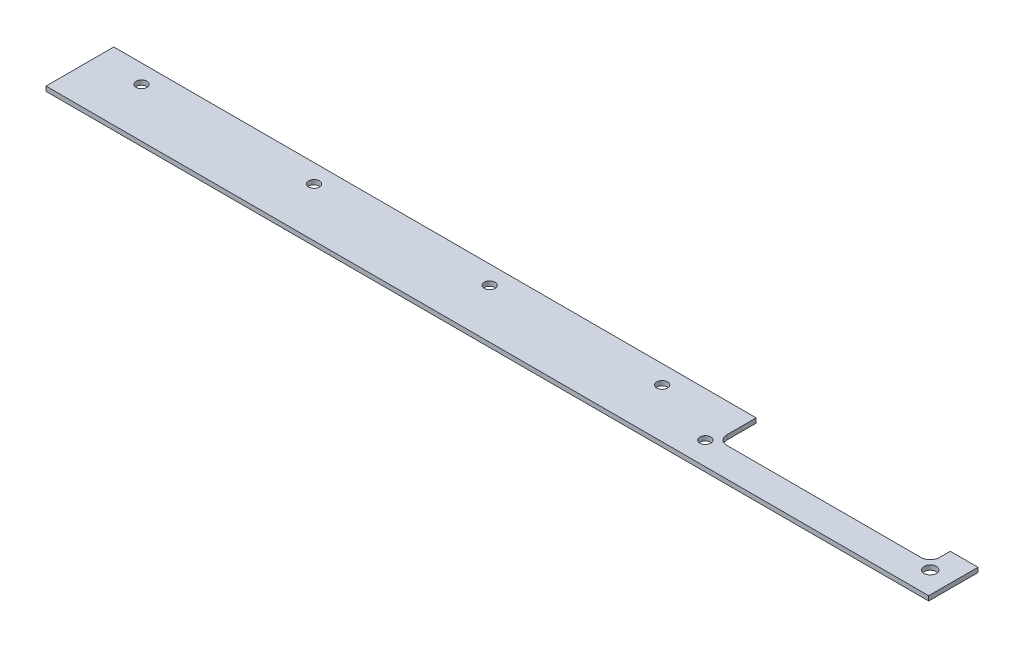
ISO-10303-21;
HEADER;
FILE_DESCRIPTION(('STEP AP214'),'2;1');
FILE_NAME('part.step','',(''),(''),'','','');
FILE_SCHEMA(('AUTOMOTIVE_DESIGN { 1 0 10303 214 1 1 1 1 }'));
ENDSEC;
DATA;
#1=APPLICATION_CONTEXT('core data for automotive mechanical design processes');
#2=APPLICATION_PROTOCOL_DEFINITION('international standard','automotive_design',2000,#1);
#3=PRODUCT_CONTEXT('',#1,'mechanical');
#4=PRODUCT('Part','Part','',(#3));
#5=PRODUCT_RELATED_PRODUCT_CATEGORY('part','',(#4));
#6=PRODUCT_DEFINITION_FORMATION('','',#4);
#7=PRODUCT_DEFINITION_CONTEXT('part definition',#1,'design');
#8=PRODUCT_DEFINITION('design','',#6,#7);
#9=PRODUCT_DEFINITION_SHAPE('','',#8);
#10=(LENGTH_UNIT() NAMED_UNIT(*) SI_UNIT(.MILLI.,.METRE.));
#11=(NAMED_UNIT(*) PLANE_ANGLE_UNIT() SI_UNIT($,.RADIAN.));
#12=(NAMED_UNIT(*) SI_UNIT($,.STERADIAN.) SOLID_ANGLE_UNIT());
#13=UNCERTAINTY_MEASURE_WITH_UNIT(LENGTH_MEASURE(1.E-05),#10,'distance_accuracy_value','');
#14=(GEOMETRIC_REPRESENTATION_CONTEXT(3) GLOBAL_UNCERTAINTY_ASSIGNED_CONTEXT((#13)) GLOBAL_UNIT_ASSIGNED_CONTEXT((#10,
#11,#12)) REPRESENTATION_CONTEXT('',''));
#15=CARTESIAN_POINT('',(0.,0.,0.));
#16=DIRECTION('',(0.,0.,1.));
#17=DIRECTION('',(1.,0.,0.));
#18=AXIS2_PLACEMENT_3D('',#15,#16,#17);
#19=CARTESIAN_POINT('',(211.5,1.5,-12.5));
#20=DIRECTION('',(0.,1.,0.));
#21=DIRECTION('',(0.,0.,1.));
#22=AXIS2_PLACEMENT_3D('',#19,#20,#21);
#23=PLANE('',#22);
#24=CARTESIAN_POINT('',(184.,1.5,-16.));
#25=DIRECTION('',(0.,1.,0.));
#26=DIRECTION('',(0.,0.,1.));
#27=AXIS2_PLACEMENT_3D('',#24,#25,#26);
#28=CIRCLE('',#27,1.74999999999998);
#29=CARTESIAN_POINT('',(184.,1.5,-14.25));
#30=VERTEX_POINT('',#29);
#31=EDGE_CURVE('E273',#30,#30,#28,.T.);
#32=ORIENTED_EDGE('',*,*,#31,.F.);
#33=EDGE_LOOP('',(#32));
#34=FACE_BOUND('',#33,.T.);
#35=CARTESIAN_POINT('',(206.5,1.5,-7.5));
#36=DIRECTION('',(0.,1.,0.));
#37=DIRECTION('',(0.,0.,1.));
#38=AXIS2_PLACEMENT_3D('',#35,#36,#37);
#39=CIRCLE('',#38,1.75000000000001);
#40=CARTESIAN_POINT('',(206.5,1.5,-5.74999999999999));
#41=VERTEX_POINT('',#40);
#42=EDGE_CURVE('E257',#41,#41,#39,.T.);
#43=ORIENTED_EDGE('',*,*,#42,.F.);
#44=EDGE_LOOP('',(#43));
#45=FACE_BOUND('',#44,.T.);
#46=CARTESIAN_POINT('',(15.,1.5,-16.));
#47=DIRECTION('',(0.,1.,0.));
#48=DIRECTION('',(0.,0.,1.));
#49=AXIS2_PLACEMENT_3D('',#46,#47,#48);
#50=CIRCLE('',#49,1.75);
#51=CARTESIAN_POINT('',(15.,1.5,-14.25));
#52=VERTEX_POINT('',#51);
#53=EDGE_CURVE('E158',#52,#52,#50,.T.);
#54=ORIENTED_EDGE('',*,*,#53,.F.);
#55=EDGE_LOOP('',(#54));
#56=FACE_BOUND('',#55,.T.);
#57=DIRECTION('',(0.,0.,1.));
#58=VECTOR('',#57,1.);
#59=CARTESIAN_POINT('',(0.,1.5,0.));
#60=LINE('',#59,#58);
#61=CARTESIAN_POINT('',(0.,1.5,-22.));
#62=VERTEX_POINT('',#61);
#63=CARTESIAN_POINT('',(0.,1.5,0.));
#64=VERTEX_POINT('',#63);
#65=EDGE_CURVE('E182',#62,#64,#60,.T.);
#66=ORIENTED_EDGE('',*,*,#65,.T.);
#67=DIRECTION('',(1.,0.,0.));
#68=VECTOR('',#67,1.);
#69=CARTESIAN_POINT('',(0.,1.5,0.));
#70=LINE('',#69,#68);
#71=CARTESIAN_POINT('',(286.5,1.5,0.));
#72=VERTEX_POINT('',#71);
#73=EDGE_CURVE('E106',#64,#72,#70,.T.);
#74=ORIENTED_EDGE('',*,*,#73,.T.);
#75=DIRECTION('',(0.,0.,-1.));
#76=VECTOR('',#75,1.);
#77=CARTESIAN_POINT('',(286.5,1.5,-16.));
#78=LINE('',#77,#76);
#79=CARTESIAN_POINT('',(286.5,1.5,-16.));
#80=VERTEX_POINT('',#79);
#81=EDGE_CURVE('E211',#72,#80,#78,.T.);
#82=ORIENTED_EDGE('',*,*,#81,.T.);
#83=DIRECTION('',(-1.,0.,0.));
#84=VECTOR('',#83,1.);
#85=CARTESIAN_POINT('',(277.5,1.5,-16.));
#86=LINE('',#85,#84);
#87=CARTESIAN_POINT('',(277.5,1.5,-16.));
#88=VERTEX_POINT('',#87);
#89=EDGE_CURVE('E231',#80,#88,#86,.T.);
#90=ORIENTED_EDGE('',*,*,#89,.T.);
#91=DIRECTION('',(0.,0.,1.));
#92=VECTOR('',#91,1.);
#93=CARTESIAN_POINT('',(277.5,1.5,-12.5));
#94=LINE('',#93,#92);
#95=CARTESIAN_POINT('',(277.5,1.5,-12.5));
#96=VERTEX_POINT('',#95);
#97=EDGE_CURVE('E227',#88,#96,#94,.T.);
#98=ORIENTED_EDGE('',*,*,#97,.T.);
#99=CARTESIAN_POINT('',(274.5,1.5,-12.5));
#100=DIRECTION('',(0.,-1.,0.));
#101=DIRECTION('',(0.,0.,1.));
#102=AXIS2_PLACEMENT_3D('',#99,#100,#101);
#103=CIRCLE('',#102,3.);
#104=CARTESIAN_POINT('',(274.5,1.5,-9.5));
#105=VERTEX_POINT('',#104);
#106=EDGE_CURVE('E230',#96,#105,#103,.T.);
#107=ORIENTED_EDGE('',*,*,#106,.T.);
#108=DIRECTION('',(-1.,0.,0.));
#109=VECTOR('',#108,1.);
#110=CARTESIAN_POINT('',(211.5,1.5,-9.5));
#111=LINE('',#110,#109);
#112=CARTESIAN_POINT('',(211.5,1.5,-9.5));
#113=VERTEX_POINT('',#112);
#114=EDGE_CURVE('E131',#105,#113,#111,.T.);
#115=ORIENTED_EDGE('',*,*,#114,.T.);
#116=CARTESIAN_POINT('',(211.5,1.5,-12.5));
#117=DIRECTION('',(0.,-1.,0.));
#118=DIRECTION('',(0.,0.,1.));
#119=AXIS2_PLACEMENT_3D('',#116,#117,#118);
#120=CIRCLE('',#119,3.);
#121=CARTESIAN_POINT('',(208.5,1.5,-12.5));
#122=VERTEX_POINT('',#121);
#123=EDGE_CURVE('E125',#113,#122,#120,.T.);
#124=ORIENTED_EDGE('',*,*,#123,.T.);
#125=DIRECTION('',(0.,0.,-1.));
#126=VECTOR('',#125,1.);
#127=CARTESIAN_POINT('',(208.5,1.5,-22.));
#128=LINE('',#127,#126);
#129=CARTESIAN_POINT('',(208.5,1.5,-22.));
#130=VERTEX_POINT('',#129);
#131=EDGE_CURVE('E129',#122,#130,#128,.T.);
#132=ORIENTED_EDGE('',*,*,#131,.T.);
#133=DIRECTION('',(-1.,0.,0.));
#134=VECTOR('',#133,1.);
#135=CARTESIAN_POINT('',(0.,1.5,-22.));
#136=LINE('',#135,#134);
#137=EDGE_CURVE('E57',#130,#62,#136,.T.);
#138=ORIENTED_EDGE('',*,*,#137,.T.);
#139=EDGE_LOOP('',(#66,#74,#82,#90,#98,#107,#115,#124,#132,#138));
#140=FACE_BOUND('',#139,.T.);
#141=CARTESIAN_POINT('',(71.,1.5,-16.));
#142=DIRECTION('',(0.,1.,0.));
#143=DIRECTION('',(0.,0.,1.));
#144=AXIS2_PLACEMENT_3D('',#141,#142,#143);
#145=CIRCLE('',#144,1.75);
#146=CARTESIAN_POINT('',(71.,1.5,-14.25));
#147=VERTEX_POINT('',#146);
#148=EDGE_CURVE('E249',#147,#147,#145,.T.);
#149=ORIENTED_EDGE('',*,*,#148,.F.);
#150=EDGE_LOOP('',(#149));
#151=FACE_BOUND('',#150,.T.);
#152=CARTESIAN_POINT('',(128.,1.5,-16.));
#153=DIRECTION('',(0.,1.,0.));
#154=DIRECTION('',(0.,0.,1.));
#155=AXIS2_PLACEMENT_3D('',#152,#153,#154);
#156=CIRCLE('',#155,1.75000000000001);
#157=CARTESIAN_POINT('',(128.,1.5,-14.25));
#158=VERTEX_POINT('',#157);
#159=EDGE_CURVE('E265',#158,#158,#156,.T.);
#160=ORIENTED_EDGE('',*,*,#159,.F.);
#161=EDGE_LOOP('',(#160));
#162=FACE_BOUND('',#161,.T.);
#163=CARTESIAN_POINT('',(279.5,1.5,-7.5));
#164=DIRECTION('',(0.,1.,0.));
#165=DIRECTION('',(0.,0.,1.));
#166=AXIS2_PLACEMENT_3D('',#163,#164,#165);
#167=CIRCLE('',#166,2.);
#168=CARTESIAN_POINT('',(279.5,1.5,-5.5));
#169=VERTEX_POINT('',#168);
#170=EDGE_CURVE('E281',#169,#169,#167,.T.);
#171=ORIENTED_EDGE('',*,*,#170,.F.);
#172=EDGE_LOOP('',(#171));
#173=FACE_BOUND('',#172,.T.);
#174=ADVANCED_FACE('F39',(#34,#45,#56,#140,#151,#162,#173),#23,.T.);
#175=CARTESIAN_POINT('',(211.5,0.,-12.5));
#176=DIRECTION('',(0.,1.,0.));
#177=DIRECTION('',(0.,0.,1.));
#178=AXIS2_PLACEMENT_3D('',#175,#176,#177);
#179=PLANE('',#178);
#180=DIRECTION('',(0.,0.,1.));
#181=VECTOR('',#180,1.);
#182=CARTESIAN_POINT('',(0.,0.,0.));
#183=LINE('',#182,#181);
#184=CARTESIAN_POINT('',(0.,0.,-22.));
#185=VERTEX_POINT('',#184);
#186=CARTESIAN_POINT('',(0.,0.,0.));
#187=VERTEX_POINT('',#186);
#188=EDGE_CURVE('E153',#185,#187,#183,.T.);
#189=ORIENTED_EDGE('',*,*,#188,.F.);
#190=DIRECTION('',(-1.,0.,0.));
#191=VECTOR('',#190,1.);
#192=CARTESIAN_POINT('',(0.,0.,-22.));
#193=LINE('',#192,#191);
#194=CARTESIAN_POINT('',(208.5,0.,-22.));
#195=VERTEX_POINT('',#194);
#196=EDGE_CURVE('E98',#195,#185,#193,.T.);
#197=ORIENTED_EDGE('',*,*,#196,.F.);
#198=DIRECTION('',(0.,0.,-1.));
#199=VECTOR('',#198,1.);
#200=CARTESIAN_POINT('',(208.5,0.,-22.));
#201=LINE('',#200,#199);
#202=CARTESIAN_POINT('',(208.5,0.,-12.5));
#203=VERTEX_POINT('',#202);
#204=EDGE_CURVE('E92',#203,#195,#201,.T.);
#205=ORIENTED_EDGE('',*,*,#204,.F.);
#206=CARTESIAN_POINT('',(211.5,0.,-12.5));
#207=DIRECTION('',(0.,-1.,0.));
#208=DIRECTION('',(0.,0.,1.));
#209=AXIS2_PLACEMENT_3D('',#206,#207,#208);
#210=CIRCLE('',#209,3.);
#211=CARTESIAN_POINT('',(211.5,0.,-9.5));
#212=VERTEX_POINT('',#211);
#213=EDGE_CURVE('E140',#212,#203,#210,.T.);
#214=ORIENTED_EDGE('',*,*,#213,.F.);
#215=DIRECTION('',(-1.,0.,0.));
#216=VECTOR('',#215,1.);
#217=CARTESIAN_POINT('',(211.5,0.,-9.5));
#218=LINE('',#217,#216);
#219=CARTESIAN_POINT('',(274.5,0.,-9.5));
#220=VERTEX_POINT('',#219);
#221=EDGE_CURVE('E173',#220,#212,#218,.T.);
#222=ORIENTED_EDGE('',*,*,#221,.F.);
#223=CARTESIAN_POINT('',(274.5,0.,-12.5));
#224=DIRECTION('',(0.,-1.,0.));
#225=DIRECTION('',(0.,0.,1.));
#226=AXIS2_PLACEMENT_3D('',#223,#224,#225);
#227=CIRCLE('',#226,3.);
#228=CARTESIAN_POINT('',(277.5,0.,-12.5));
#229=VERTEX_POINT('',#228);
#230=EDGE_CURVE('E170',#229,#220,#227,.T.);
#231=ORIENTED_EDGE('',*,*,#230,.F.);
#232=DIRECTION('',(0.,0.,1.));
#233=VECTOR('',#232,1.);
#234=CARTESIAN_POINT('',(277.5,0.,-12.5));
#235=LINE('',#234,#233);
#236=CARTESIAN_POINT('',(277.5,0.,-16.));
#237=VERTEX_POINT('',#236);
#238=EDGE_CURVE('E167',#237,#229,#235,.T.);
#239=ORIENTED_EDGE('',*,*,#238,.F.);
#240=DIRECTION('',(-1.,0.,0.));
#241=VECTOR('',#240,1.);
#242=CARTESIAN_POINT('',(277.5,0.,-16.));
#243=LINE('',#242,#241);
#244=CARTESIAN_POINT('',(286.5,0.,-16.));
#245=VERTEX_POINT('',#244);
#246=EDGE_CURVE('E164',#245,#237,#243,.T.);
#247=ORIENTED_EDGE('',*,*,#246,.F.);
#248=DIRECTION('',(0.,0.,-1.));
#249=VECTOR('',#248,1.);
#250=CARTESIAN_POINT('',(286.5,0.,-16.));
#251=LINE('',#250,#249);
#252=CARTESIAN_POINT('',(286.5,0.,0.));
#253=VERTEX_POINT('',#252);
#254=EDGE_CURVE('E161',#253,#245,#251,.T.);
#255=ORIENTED_EDGE('',*,*,#254,.F.);
#256=DIRECTION('',(1.,0.,0.));
#257=VECTOR('',#256,1.);
#258=CARTESIAN_POINT('',(0.,0.,0.));
#259=LINE('',#258,#257);
#260=EDGE_CURVE('E157',#187,#253,#259,.T.);
#261=ORIENTED_EDGE('',*,*,#260,.F.);
#262=EDGE_LOOP('',(#189,#197,#205,#214,#222,#231,#239,#247,#255,#261));
#263=FACE_BOUND('',#262,.T.);
#264=CARTESIAN_POINT('',(15.,0.,-16.));
#265=DIRECTION('',(0.,1.,0.));
#266=DIRECTION('',(0.,0.,1.));
#267=AXIS2_PLACEMENT_3D('',#264,#265,#266);
#268=CIRCLE('',#267,1.75);
#269=CARTESIAN_POINT('',(15.,0.,-14.25));
#270=VERTEX_POINT('',#269);
#271=EDGE_CURVE('E245',#270,#270,#268,.T.);
#272=ORIENTED_EDGE('',*,*,#271,.T.);
#273=EDGE_LOOP('',(#272));
#274=FACE_BOUND('',#273,.T.);
#275=CARTESIAN_POINT('',(71.,0.,-16.));
#276=DIRECTION('',(0.,1.,0.));
#277=DIRECTION('',(0.,0.,1.));
#278=AXIS2_PLACEMENT_3D('',#275,#276,#277);
#279=CIRCLE('',#278,1.75);
#280=CARTESIAN_POINT('',(71.,0.,-14.25));
#281=VERTEX_POINT('',#280);
#282=EDGE_CURVE('E253',#281,#281,#279,.T.);
#283=ORIENTED_EDGE('',*,*,#282,.T.);
#284=EDGE_LOOP('',(#283));
#285=FACE_BOUND('',#284,.T.);
#286=CARTESIAN_POINT('',(206.5,0.,-7.5));
#287=DIRECTION('',(0.,1.,0.));
#288=DIRECTION('',(0.,0.,1.));
#289=AXIS2_PLACEMENT_3D('',#286,#287,#288);
#290=CIRCLE('',#289,1.75000000000001);
#291=CARTESIAN_POINT('',(206.5,0.,-5.74999999999999));
#292=VERTEX_POINT('',#291);
#293=EDGE_CURVE('E261',#292,#292,#290,.T.);
#294=ORIENTED_EDGE('',*,*,#293,.T.);
#295=EDGE_LOOP('',(#294));
#296=FACE_BOUND('',#295,.T.);
#297=CARTESIAN_POINT('',(128.,0.,-16.));
#298=DIRECTION('',(0.,1.,0.));
#299=DIRECTION('',(0.,0.,1.));
#300=AXIS2_PLACEMENT_3D('',#297,#298,#299);
#301=CIRCLE('',#300,1.75000000000001);
#302=CARTESIAN_POINT('',(128.,0.,-14.25));
#303=VERTEX_POINT('',#302);
#304=EDGE_CURVE('E269',#303,#303,#301,.T.);
#305=ORIENTED_EDGE('',*,*,#304,.T.);
#306=EDGE_LOOP('',(#305));
#307=FACE_BOUND('',#306,.T.);
#308=CARTESIAN_POINT('',(184.,0.,-16.));
#309=DIRECTION('',(0.,1.,0.));
#310=DIRECTION('',(0.,0.,1.));
#311=AXIS2_PLACEMENT_3D('',#308,#309,#310);
#312=CIRCLE('',#311,1.74999999999998);
#313=CARTESIAN_POINT('',(184.,0.,-14.25));
#314=VERTEX_POINT('',#313);
#315=EDGE_CURVE('E277',#314,#314,#312,.T.);
#316=ORIENTED_EDGE('',*,*,#315,.T.);
#317=EDGE_LOOP('',(#316));
#318=FACE_BOUND('',#317,.T.);
#319=CARTESIAN_POINT('',(279.5,0.,-7.5));
#320=DIRECTION('',(0.,1.,0.));
#321=DIRECTION('',(0.,0.,1.));
#322=AXIS2_PLACEMENT_3D('',#319,#320,#321);
#323=CIRCLE('',#322,2.);
#324=CARTESIAN_POINT('',(279.5,0.,-5.5));
#325=VERTEX_POINT('',#324);
#326=EDGE_CURVE('E285',#325,#325,#323,.T.);
#327=ORIENTED_EDGE('',*,*,#326,.T.);
#328=EDGE_LOOP('',(#327));
#329=FACE_BOUND('',#328,.T.);
#330=ADVANCED_FACE('F215',(#263,#274,#285,#296,#307,#318,#329),#179,.F.);
#331=CARTESIAN_POINT('',(0.,1.5,0.));
#332=DIRECTION('',(1.,0.,0.));
#333=DIRECTION('',(0.,0.,-1.));
#334=AXIS2_PLACEMENT_3D('',#331,#332,#333);
#335=PLANE('',#334);
#336=ORIENTED_EDGE('',*,*,#188,.T.);
#337=DIRECTION('',(0.,-1.,0.));
#338=VECTOR('',#337,1.);
#339=CARTESIAN_POINT('',(0.,1.5,0.));
#340=LINE('',#339,#338);
#341=EDGE_CURVE('E11',#64,#187,#340,.T.);
#342=ORIENTED_EDGE('',*,*,#341,.F.);
#343=ORIENTED_EDGE('',*,*,#65,.F.);
#344=DIRECTION('',(0.,-1.,0.));
#345=VECTOR('',#344,1.);
#346=CARTESIAN_POINT('',(0.,1.5,-22.));
#347=LINE('',#346,#345);
#348=EDGE_CURVE('E149',#62,#185,#347,.T.);
#349=ORIENTED_EDGE('',*,*,#348,.T.);
#350=EDGE_LOOP('',(#336,#342,#343,#349));
#351=FACE_BOUND('',#350,.T.);
#352=ADVANCED_FACE('F41',(#351),#335,.F.);
#353=CARTESIAN_POINT('',(0.,1.5,0.));
#354=DIRECTION('',(0.,0.,-1.));
#355=DIRECTION('',(-1.,0.,0.));
#356=AXIS2_PLACEMENT_3D('',#353,#354,#355);
#357=PLANE('',#356);
#358=ORIENTED_EDGE('',*,*,#260,.T.);
#359=DIRECTION('',(0.,-1.,0.));
#360=VECTOR('',#359,1.);
#361=CARTESIAN_POINT('',(286.5,1.5,0.));
#362=LINE('',#361,#360);
#363=EDGE_CURVE('E49',#72,#253,#362,.T.);
#364=ORIENTED_EDGE('',*,*,#363,.F.);
#365=ORIENTED_EDGE('',*,*,#73,.F.);
#366=ORIENTED_EDGE('',*,*,#341,.T.);
#367=EDGE_LOOP('',(#358,#364,#365,#366));
#368=FACE_BOUND('',#367,.T.);
#369=ADVANCED_FACE('F329',(#368),#357,.F.);
#370=CARTESIAN_POINT('',(286.5,1.5,-16.));
#371=DIRECTION('',(-1.,0.,0.));
#372=DIRECTION('',(0.,0.,1.));
#373=AXIS2_PLACEMENT_3D('',#370,#371,#372);
#374=PLANE('',#373);
#375=ORIENTED_EDGE('',*,*,#254,.T.);
#376=DIRECTION('',(0.,-1.,0.));
#377=VECTOR('',#376,1.);
#378=CARTESIAN_POINT('',(286.5,1.5,-16.));
#379=LINE('',#378,#377);
#380=EDGE_CURVE('E201',#80,#245,#379,.T.);
#381=ORIENTED_EDGE('',*,*,#380,.F.);
#382=ORIENTED_EDGE('',*,*,#81,.F.);
#383=ORIENTED_EDGE('',*,*,#363,.T.);
#384=EDGE_LOOP('',(#375,#381,#382,#383));
#385=FACE_BOUND('',#384,.T.);
#386=ADVANCED_FACE('F209',(#385),#374,.F.);
#387=CARTESIAN_POINT('',(277.5,1.5,-16.));
#388=DIRECTION('',(0.,0.,1.));
#389=DIRECTION('',(1.,0.,0.));
#390=AXIS2_PLACEMENT_3D('',#387,#388,#389);
#391=PLANE('',#390);
#392=ORIENTED_EDGE('',*,*,#246,.T.);
#393=DIRECTION('',(0.,-1.,0.));
#394=VECTOR('',#393,1.);
#395=CARTESIAN_POINT('',(277.5,1.5,-16.));
#396=LINE('',#395,#394);
#397=EDGE_CURVE('E197',#88,#237,#396,.T.);
#398=ORIENTED_EDGE('',*,*,#397,.F.);
#399=ORIENTED_EDGE('',*,*,#89,.F.);
#400=ORIENTED_EDGE('',*,*,#380,.T.);
#401=EDGE_LOOP('',(#392,#398,#399,#400));
#402=FACE_BOUND('',#401,.T.);
#403=ADVANCED_FACE('F221',(#402),#391,.F.);
#404=CARTESIAN_POINT('',(277.5,1.5,-12.5));
#405=DIRECTION('',(1.,0.,0.));
#406=DIRECTION('',(0.,0.,-1.));
#407=AXIS2_PLACEMENT_3D('',#404,#405,#406);
#408=PLANE('',#407);
#409=ORIENTED_EDGE('',*,*,#238,.T.);
#410=DIRECTION('',(0.,-1.,0.));
#411=VECTOR('',#410,1.);
#412=CARTESIAN_POINT('',(277.5,1.5,-12.5));
#413=LINE('',#412,#411);
#414=EDGE_CURVE('E193',#96,#229,#413,.T.);
#415=ORIENTED_EDGE('',*,*,#414,.F.);
#416=ORIENTED_EDGE('',*,*,#97,.F.);
#417=ORIENTED_EDGE('',*,*,#397,.T.);
#418=EDGE_LOOP('',(#409,#415,#416,#417));
#419=FACE_BOUND('',#418,.T.);
#420=ADVANCED_FACE('F225',(#419),#408,.F.);
#421=CARTESIAN_POINT('',(274.5,1.5,-12.5));
#422=DIRECTION('',(0.,-1.,0.));
#423=DIRECTION('',(0.,0.,-1.));
#424=AXIS2_PLACEMENT_3D('',#421,#422,#423);
#425=CYLINDRICAL_SURFACE('',#424,3.);
#426=ORIENTED_EDGE('',*,*,#230,.T.);
#427=DIRECTION('',(0.,-1.,0.));
#428=VECTOR('',#427,1.);
#429=CARTESIAN_POINT('',(274.5,1.5,-9.5));
#430=LINE('',#429,#428);
#431=EDGE_CURVE('E189',#105,#220,#430,.T.);
#432=ORIENTED_EDGE('',*,*,#431,.F.);
#433=ORIENTED_EDGE('',*,*,#106,.F.);
#434=ORIENTED_EDGE('',*,*,#414,.T.);
#435=EDGE_LOOP('',(#426,#432,#433,#434));
#436=FACE_BOUND('',#435,.T.);
#437=ADVANCED_FACE('F319',(#436),#425,.F.);
#438=CARTESIAN_POINT('',(211.5,1.5,-9.5));
#439=DIRECTION('',(0.,0.,1.));
#440=DIRECTION('',(1.,0.,0.));
#441=AXIS2_PLACEMENT_3D('',#438,#439,#440);
#442=PLANE('',#441);
#443=ORIENTED_EDGE('',*,*,#221,.T.);
#444=DIRECTION('',(0.,-1.,0.));
#445=VECTOR('',#444,1.);
#446=CARTESIAN_POINT('',(211.5,1.5,-9.5));
#447=LINE('',#446,#445);
#448=EDGE_CURVE('E142',#113,#212,#447,.T.);
#449=ORIENTED_EDGE('',*,*,#448,.F.);
#450=ORIENTED_EDGE('',*,*,#114,.F.);
#451=ORIENTED_EDGE('',*,*,#431,.T.);
#452=EDGE_LOOP('',(#443,#449,#450,#451));
#453=FACE_BOUND('',#452,.T.);
#454=ADVANCED_FACE('F316',(#453),#442,.F.);
#455=CARTESIAN_POINT('',(211.5,1.5,-12.5));
#456=DIRECTION('',(0.,-1.,0.));
#457=DIRECTION('',(0.,0.,-1.));
#458=AXIS2_PLACEMENT_3D('',#455,#456,#457);
#459=CYLINDRICAL_SURFACE('',#458,3.);
#460=ORIENTED_EDGE('',*,*,#213,.T.);
#461=DIRECTION('',(0.,-1.,0.));
#462=VECTOR('',#461,1.);
#463=CARTESIAN_POINT('',(208.5,1.5,-12.5));
#464=LINE('',#463,#462);
#465=EDGE_CURVE('E137',#122,#203,#464,.T.);
#466=ORIENTED_EDGE('',*,*,#465,.F.);
#467=ORIENTED_EDGE('',*,*,#123,.F.);
#468=ORIENTED_EDGE('',*,*,#448,.T.);
#469=EDGE_LOOP('',(#460,#466,#467,#468));
#470=FACE_BOUND('',#469,.T.);
#471=ADVANCED_FACE('F138',(#470),#459,.F.);
#472=CARTESIAN_POINT('',(208.5,1.5,-22.));
#473=DIRECTION('',(-1.,0.,0.));
#474=DIRECTION('',(0.,0.,1.));
#475=AXIS2_PLACEMENT_3D('',#472,#473,#474);
#476=PLANE('',#475);
#477=ORIENTED_EDGE('',*,*,#204,.T.);
#478=DIRECTION('',(0.,-1.,0.));
#479=VECTOR('',#478,1.);
#480=CARTESIAN_POINT('',(208.5,1.5,-22.));
#481=LINE('',#480,#479);
#482=EDGE_CURVE('E143',#130,#195,#481,.T.);
#483=ORIENTED_EDGE('',*,*,#482,.F.);
#484=ORIENTED_EDGE('',*,*,#131,.F.);
#485=ORIENTED_EDGE('',*,*,#465,.T.);
#486=EDGE_LOOP('',(#477,#483,#484,#485));
#487=FACE_BOUND('',#486,.T.);
#488=ADVANCED_FACE('F145',(#487),#476,.F.);
#489=CARTESIAN_POINT('',(0.,1.5,-22.));
#490=DIRECTION('',(0.,0.,1.));
#491=DIRECTION('',(1.,0.,0.));
#492=AXIS2_PLACEMENT_3D('',#489,#490,#491);
#493=PLANE('',#492);
#494=ORIENTED_EDGE('',*,*,#196,.T.);
#495=ORIENTED_EDGE('',*,*,#348,.F.);
#496=ORIENTED_EDGE('',*,*,#137,.F.);
#497=ORIENTED_EDGE('',*,*,#482,.T.);
#498=EDGE_LOOP('',(#494,#495,#496,#497));
#499=FACE_BOUND('',#498,.T.);
#500=ADVANCED_FACE('F309',(#499),#493,.F.);
#501=CARTESIAN_POINT('',(15.,1.5,-16.));
#502=DIRECTION('',(0.,-1.,0.));
#503=DIRECTION('',(0.,0.,-1.));
#504=AXIS2_PLACEMENT_3D('',#501,#502,#503);
#505=CYLINDRICAL_SURFACE('',#504,1.75);
#506=ORIENTED_EDGE('',*,*,#53,.T.);
#507=EDGE_LOOP('',(#506));
#508=FACE_BOUND('',#507,.T.);
#509=ORIENTED_EDGE('',*,*,#271,.F.);
#510=EDGE_LOOP('',(#509));
#511=FACE_BOUND('',#510,.T.);
#512=ADVANCED_FACE('F306',(#508,#511),#505,.F.);
#513=CARTESIAN_POINT('',(71.,1.5,-16.));
#514=DIRECTION('',(0.,-1.,0.));
#515=DIRECTION('',(0.,0.,-1.));
#516=AXIS2_PLACEMENT_3D('',#513,#514,#515);
#517=CYLINDRICAL_SURFACE('',#516,1.75);
#518=ORIENTED_EDGE('',*,*,#148,.T.);
#519=EDGE_LOOP('',(#518));
#520=FACE_BOUND('',#519,.T.);
#521=ORIENTED_EDGE('',*,*,#282,.F.);
#522=EDGE_LOOP('',(#521));
#523=FACE_BOUND('',#522,.T.);
#524=ADVANCED_FACE('F405',(#520,#523),#517,.F.);
#525=CARTESIAN_POINT('',(206.5,1.5,-7.5));
#526=DIRECTION('',(0.,-1.,0.));
#527=DIRECTION('',(0.,0.,-1.));
#528=AXIS2_PLACEMENT_3D('',#525,#526,#527);
#529=CYLINDRICAL_SURFACE('',#528,1.75000000000001);
#530=ORIENTED_EDGE('',*,*,#42,.T.);
#531=EDGE_LOOP('',(#530));
#532=FACE_BOUND('',#531,.T.);
#533=ORIENTED_EDGE('',*,*,#293,.F.);
#534=EDGE_LOOP('',(#533));
#535=FACE_BOUND('',#534,.T.);
#536=ADVANCED_FACE('F413',(#532,#535),#529,.F.);
#537=CARTESIAN_POINT('',(128.,1.5,-16.));
#538=DIRECTION('',(0.,-1.,0.));
#539=DIRECTION('',(0.,0.,-1.));
#540=AXIS2_PLACEMENT_3D('',#537,#538,#539);
#541=CYLINDRICAL_SURFACE('',#540,1.75000000000001);
#542=ORIENTED_EDGE('',*,*,#159,.T.);
#543=EDGE_LOOP('',(#542));
#544=FACE_BOUND('',#543,.T.);
#545=ORIENTED_EDGE('',*,*,#304,.F.);
#546=EDGE_LOOP('',(#545));
#547=FACE_BOUND('',#546,.T.);
#548=ADVANCED_FACE('F421',(#544,#547),#541,.F.);
#549=CARTESIAN_POINT('',(184.,1.5,-16.));
#550=DIRECTION('',(0.,-1.,0.));
#551=DIRECTION('',(0.,0.,-1.));
#552=AXIS2_PLACEMENT_3D('',#549,#550,#551);
#553=CYLINDRICAL_SURFACE('',#552,1.74999999999998);
#554=ORIENTED_EDGE('',*,*,#31,.T.);
#555=EDGE_LOOP('',(#554));
#556=FACE_BOUND('',#555,.T.);
#557=ORIENTED_EDGE('',*,*,#315,.F.);
#558=EDGE_LOOP('',(#557));
#559=FACE_BOUND('',#558,.T.);
#560=ADVANCED_FACE('F430',(#556,#559),#553,.F.);
#561=CARTESIAN_POINT('',(279.5,1.5,-7.5));
#562=DIRECTION('',(0.,-1.,0.));
#563=DIRECTION('',(0.,0.,-1.));
#564=AXIS2_PLACEMENT_3D('',#561,#562,#563);
#565=CYLINDRICAL_SURFACE('',#564,2.);
#566=ORIENTED_EDGE('',*,*,#170,.T.);
#567=EDGE_LOOP('',(#566));
#568=FACE_BOUND('',#567,.T.);
#569=ORIENTED_EDGE('',*,*,#326,.F.);
#570=EDGE_LOOP('',(#569));
#571=FACE_BOUND('',#570,.T.);
#572=ADVANCED_FACE('F293',(#568,#571),#565,.F.);
#573=CLOSED_SHELL('',(#174,#330,#352,#369,#386,#403,#420,#437,#454,#471,#488,#500,#512,#524,
#536,#548,#560,#572));
#574=MANIFOLD_SOLID_BREP('B2',#573);
#575=ADVANCED_BREP_SHAPE_REPRESENTATION('',(#18,#574),#14);
#576=SHAPE_DEFINITION_REPRESENTATION(#9,#575);
ENDSEC;
END-ISO-10303-21;
